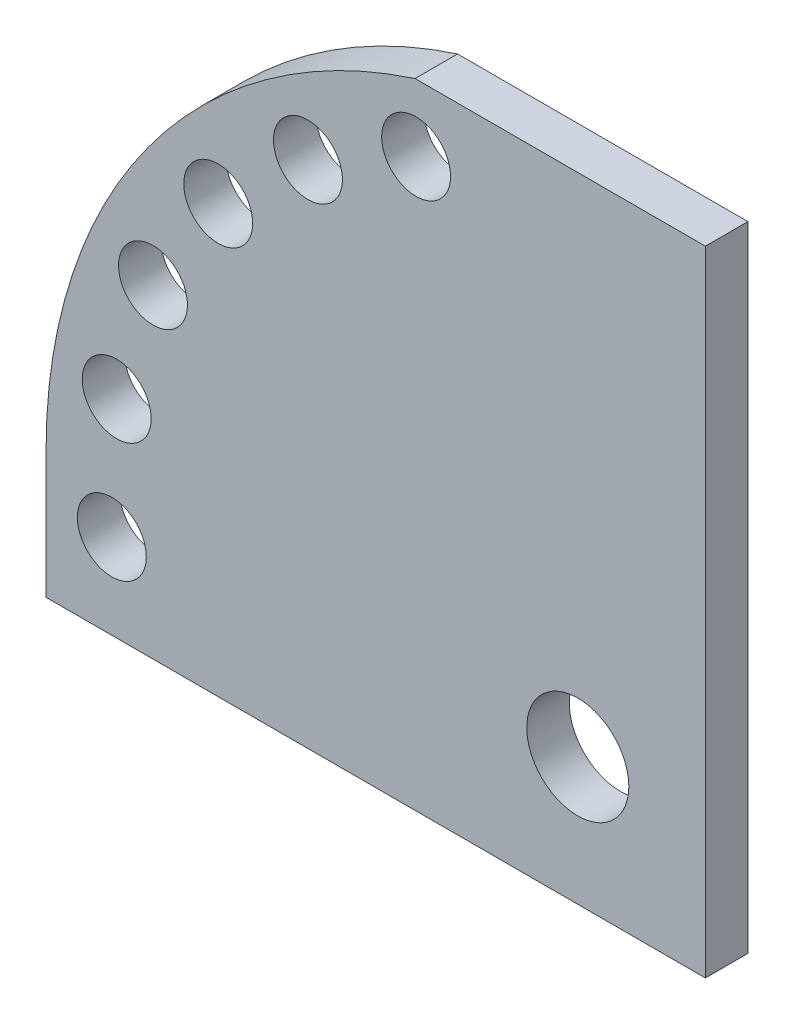
ISO-10303-21;
HEADER;
FILE_DESCRIPTION(('STEP AP214'),'2;1');
FILE_NAME('part.step','',(''),(''),'','','');
FILE_SCHEMA(('AUTOMOTIVE_DESIGN { 1 0 10303 214 1 1 1 1 }'));
ENDSEC;
DATA;
#1=APPLICATION_CONTEXT('core data for automotive mechanical design processes');
#2=APPLICATION_PROTOCOL_DEFINITION('international standard','automotive_design',2000,#1);
#3=PRODUCT_CONTEXT('',#1,'mechanical');
#4=PRODUCT('Part','Part','',(#3));
#5=PRODUCT_RELATED_PRODUCT_CATEGORY('part','',(#4));
#6=PRODUCT_DEFINITION_FORMATION('','',#4);
#7=PRODUCT_DEFINITION_CONTEXT('part definition',#1,'design');
#8=PRODUCT_DEFINITION('design','',#6,#7);
#9=PRODUCT_DEFINITION_SHAPE('','',#8);
#10=(LENGTH_UNIT() NAMED_UNIT(*) SI_UNIT(.MILLI.,.METRE.));
#11=(NAMED_UNIT(*) PLANE_ANGLE_UNIT() SI_UNIT($,.RADIAN.));
#12=(NAMED_UNIT(*) SI_UNIT($,.STERADIAN.) SOLID_ANGLE_UNIT());
#13=UNCERTAINTY_MEASURE_WITH_UNIT(LENGTH_MEASURE(1.E-05),#10,'distance_accuracy_value','');
#14=(GEOMETRIC_REPRESENTATION_CONTEXT(3) GLOBAL_UNCERTAINTY_ASSIGNED_CONTEXT((#13)) GLOBAL_UNIT_ASSIGNED_CONTEXT((#10,
#11,#12)) REPRESENTATION_CONTEXT('',''));
#15=CARTESIAN_POINT('',(0.,0.,0.));
#16=DIRECTION('',(0.,0.,1.));
#17=DIRECTION('',(1.,0.,0.));
#18=AXIS2_PLACEMENT_3D('',#15,#16,#17);
#19=CARTESIAN_POINT('',(15.,-15.,5.));
#20=DIRECTION('',(-1.,0.,0.));
#21=DIRECTION('',(0.,0.,1.));
#22=AXIS2_PLACEMENT_3D('',#19,#20,#21);
#23=PLANE('',#22);
#24=DIRECTION('',(0.,0.,-1.));
#25=VECTOR('',#24,1.);
#26=CARTESIAN_POINT('',(15.,59.5,142.144426609323));
#27=LINE('',#26,#25);
#28=CARTESIAN_POINT('',(15.,59.5,5.));
#29=VERTEX_POINT('',#28);
#30=CARTESIAN_POINT('',(15.,59.5,0.));
#31=VERTEX_POINT('',#30);
#32=EDGE_CURVE('E57',#29,#31,#27,.T.);
#33=ORIENTED_EDGE('',*,*,#32,.F.);
#34=DIRECTION('',(0.,1.,0.));
#35=VECTOR('',#34,1.);
#36=CARTESIAN_POINT('',(15.,-15.,5.));
#37=LINE('',#36,#35);
#38=CARTESIAN_POINT('',(15.,-15.,5.));
#39=VERTEX_POINT('',#38);
#40=EDGE_CURVE('E140',#39,#29,#37,.T.);
#41=ORIENTED_EDGE('',*,*,#40,.F.);
#42=DIRECTION('',(0.,0.,-1.));
#43=VECTOR('',#42,1.);
#44=CARTESIAN_POINT('',(15.,-15.,5.));
#45=LINE('',#44,#43);
#46=CARTESIAN_POINT('',(15.,-15.,0.));
#47=VERTEX_POINT('',#46);
#48=EDGE_CURVE('E143',#39,#47,#45,.T.);
#49=ORIENTED_EDGE('',*,*,#48,.T.);
#50=DIRECTION('',(0.,1.,0.));
#51=VECTOR('',#50,1.);
#52=CARTESIAN_POINT('',(15.,-15.,0.));
#53=LINE('',#52,#51);
#54=EDGE_CURVE('E132',#47,#31,#53,.T.);
#55=ORIENTED_EDGE('',*,*,#54,.T.);
#56=EDGE_LOOP('',(#33,#41,#49,#55));
#57=FACE_BOUND('',#56,.T.);
#58=ADVANCED_FACE('F41',(#57),#23,.F.);
#59=CARTESIAN_POINT('',(0.,0.,5.));
#60=DIRECTION('',(0.,0.,-1.));
#61=DIRECTION('',(-1.,0.,0.));
#62=AXIS2_PLACEMENT_3D('',#59,#60,#61);
#63=PLANE('',#62);
#64=CARTESIAN_POINT('',(-54.2000316190465,9.34647380001444,5.));
#65=DIRECTION('',(0.,0.,1.));
#66=DIRECTION('',(0.965925826289068,-0.258819045102521,0.));
#67=AXIS2_PLACEMENT_3D('',#64,#65,#66);
#68=CIRCLE('',#67,4.05);
#69=CARTESIAN_POINT('',(-50.2880320225758,8.29825666734923,5.));
#70=VERTEX_POINT('',#69);
#71=EDGE_CURVE('E342',#70,#70,#68,.T.);
#72=ORIENTED_EDGE('',*,*,#71,.F.);
#73=EDGE_LOOP('',(#72));
#74=FACE_BOUND('',#73,.T.);
#75=CARTESIAN_POINT('',(-49.9341649025257,23.0560008563362,5.));
#76=DIRECTION('',(0.,0.,1.));
#77=DIRECTION('',(0.866025403784438,-0.500000000000001,0.));
#78=AXIS2_PLACEMENT_3D('',#75,#76,#77);
#79=CIRCLE('',#78,4.05);
#80=CARTESIAN_POINT('',(-46.4267620171987,21.0310008563362,5.));
#81=VERTEX_POINT('',#80);
#82=EDGE_CURVE('E398',#81,#81,#79,.T.);
#83=ORIENTED_EDGE('',*,*,#82,.F.);
#84=EDGE_LOOP('',(#83));
#85=FACE_BOUND('',#84,.T.);
#86=CARTESIAN_POINT('',(-42.2653673680069,35.1942995561415,5.));
#87=DIRECTION('',(0.,0.,1.));
#88=DIRECTION('',(0.707106781186546,-0.707106781186549,0.));
#89=AXIS2_PLACEMENT_3D('',#86,#87,#88);
#90=CIRCLE('',#89,4.05);
#91=CARTESIAN_POINT('',(-39.4015849042013,32.330517092336,5.));
#92=VERTEX_POINT('',#91);
#93=EDGE_CURVE('E389',#92,#92,#90,.T.);
#94=ORIENTED_EDGE('',*,*,#93,.F.);
#95=EDGE_LOOP('',(#94));
#96=FACE_BOUND('',#95,.T.);
#97=CARTESIAN_POINT('',(-31.7162548941804,44.9341649025258,5.));
#98=DIRECTION('',(0.,0.,1.));
#99=DIRECTION('',(0.499999999999998,-0.86602540378444,0.));
#100=AXIS2_PLACEMENT_3D('',#97,#98,#99);
#101=CIRCLE('',#100,4.05);
#102=CARTESIAN_POINT('',(-29.6912548941804,41.4267620171988,5.));
#103=VERTEX_POINT('',#102);
#104=EDGE_CURVE('E356',#103,#103,#101,.T.);
#105=ORIENTED_EDGE('',*,*,#104,.F.);
#106=EDGE_LOOP('',(#105));
#107=FACE_BOUND('',#106,.T.);
#108=CARTESIAN_POINT('',(-19.005732062905,51.6118411680214,5.));
#109=DIRECTION('',(0.,0.,1.));
#110=DIRECTION('',(0.258819045102518,-0.965925826289069,0.));
#111=AXIS2_PLACEMENT_3D('',#108,#109,#110);
#112=CIRCLE('',#111,4.05);
#113=CARTESIAN_POINT('',(-17.9575149302398,47.6998415715507,5.));
#114=VERTEX_POINT('',#113);
#115=EDGE_CURVE('E345',#114,#114,#112,.T.);
#116=ORIENTED_EDGE('',*,*,#115,.F.);
#117=EDGE_LOOP('',(#116));
#118=FACE_BOUND('',#117,.T.);
#119=CARTESIAN_POINT('',(-54.7722557505166,-5.00000000000001,5.));
#120=DIRECTION('',(0.,0.,1.));
#121=DIRECTION('',(1.,0.,0.));
#122=AXIS2_PLACEMENT_3D('',#119,#120,#121);
#123=CIRCLE('',#122,4.05);
#124=CARTESIAN_POINT('',(-50.7222557505166,-5.00000000000001,5.));
#125=VERTEX_POINT('',#124);
#126=EDGE_CURVE('E335',#125,#125,#123,.T.);
#127=ORIENTED_EDGE('',*,*,#126,.F.);
#128=EDGE_LOOP('',(#127));
#129=FACE_BOUND('',#128,.T.);
#130=ORIENTED_EDGE('',*,*,#40,.T.);
#131=DIRECTION('',(-1.,0.,0.));
#132=VECTOR('',#131,1.);
#133=CARTESIAN_POINT('',(0.,59.5,5.));
#134=LINE('',#133,#132);
#135=CARTESIAN_POINT('',(-19.131126469709,59.5,5.));
#136=VERTEX_POINT('',#135);
#137=EDGE_CURVE('E64',#29,#136,#134,.T.);
#138=ORIENTED_EDGE('',*,*,#137,.T.);
#139=CARTESIAN_POINT('',(0.,0.,5.));
#140=DIRECTION('',(0.,0.,1.));
#141=DIRECTION('',(-1.,0.,0.));
#142=AXIS2_PLACEMENT_3D('',#139,#140,#141);
#143=CIRCLE('',#142,62.5);
#144=CARTESIAN_POINT('',(-62.5,0.,5.));
#145=VERTEX_POINT('',#144);
#146=EDGE_CURVE('E105',#136,#145,#143,.T.);
#147=ORIENTED_EDGE('',*,*,#146,.T.);
#148=DIRECTION('',(0.,-1.,0.));
#149=VECTOR('',#148,1.);
#150=CARTESIAN_POINT('',(-62.5,0.,5.));
#151=LINE('',#150,#149);
#152=CARTESIAN_POINT('',(-62.5,-15.,5.));
#153=VERTEX_POINT('',#152);
#154=EDGE_CURVE('E131',#145,#153,#151,.T.);
#155=ORIENTED_EDGE('',*,*,#154,.T.);
#156=DIRECTION('',(1.,0.,0.));
#157=VECTOR('',#156,1.);
#158=CARTESIAN_POINT('',(-62.5,-15.,5.));
#159=LINE('',#158,#157);
#160=EDGE_CURVE('E137',#153,#39,#159,.T.);
#161=ORIENTED_EDGE('',*,*,#160,.T.);
#162=EDGE_LOOP('',(#130,#138,#147,#155,#161));
#163=FACE_BOUND('',#162,.T.);
#164=CARTESIAN_POINT('',(0.,0.,5.));
#165=DIRECTION('',(0.,0.,1.));
#166=DIRECTION('',(1.,0.,0.));
#167=AXIS2_PLACEMENT_3D('',#164,#165,#166);
#168=CIRCLE('',#167,6.);
#169=CARTESIAN_POINT('',(6.,0.,5.));
#170=VERTEX_POINT('',#169);
#171=EDGE_CURVE('E101',#170,#170,#168,.T.);
#172=ORIENTED_EDGE('',*,*,#171,.F.);
#173=EDGE_LOOP('',(#172));
#174=FACE_BOUND('',#173,.T.);
#175=ADVANCED_FACE('F166',(#74,#85,#96,#107,#118,#129,#163,#174),#63,.F.);
#176=CARTESIAN_POINT('',(0.,0.,0.));
#177=DIRECTION('',(0.,0.,-1.));
#178=DIRECTION('',(-1.,0.,0.));
#179=AXIS2_PLACEMENT_3D('',#176,#177,#178);
#180=PLANE('',#179);
#181=DIRECTION('',(-1.,0.,0.));
#182=VECTOR('',#181,1.);
#183=CARTESIAN_POINT('',(0.,59.5,0.));
#184=LINE('',#183,#182);
#185=CARTESIAN_POINT('',(-19.131126469709,59.5,0.));
#186=VERTEX_POINT('',#185);
#187=EDGE_CURVE('E12',#31,#186,#184,.T.);
#188=ORIENTED_EDGE('',*,*,#187,.F.);
#189=ORIENTED_EDGE('',*,*,#54,.F.);
#190=DIRECTION('',(1.,0.,0.));
#191=VECTOR('',#190,1.);
#192=CARTESIAN_POINT('',(-62.5,-15.,0.));
#193=LINE('',#192,#191);
#194=CARTESIAN_POINT('',(-62.5,-15.,0.));
#195=VERTEX_POINT('',#194);
#196=EDGE_CURVE('E147',#195,#47,#193,.T.);
#197=ORIENTED_EDGE('',*,*,#196,.F.);
#198=DIRECTION('',(0.,-1.,0.));
#199=VECTOR('',#198,1.);
#200=CARTESIAN_POINT('',(-62.5,0.,0.));
#201=LINE('',#200,#199);
#202=CARTESIAN_POINT('',(-62.5,0.,0.));
#203=VERTEX_POINT('',#202);
#204=EDGE_CURVE('E96',#203,#195,#201,.T.);
#205=ORIENTED_EDGE('',*,*,#204,.F.);
#206=CARTESIAN_POINT('',(0.,0.,0.));
#207=DIRECTION('',(0.,0.,1.));
#208=DIRECTION('',(-1.,0.,0.));
#209=AXIS2_PLACEMENT_3D('',#206,#207,#208);
#210=CIRCLE('',#209,62.5);
#211=EDGE_CURVE('E90',#186,#203,#210,.T.);
#212=ORIENTED_EDGE('',*,*,#211,.F.);
#213=EDGE_LOOP('',(#188,#189,#197,#205,#212));
#214=FACE_BOUND('',#213,.T.);
#215=CARTESIAN_POINT('',(-54.2000316190465,9.34647380001444,0.));
#216=DIRECTION('',(0.,0.,1.));
#217=DIRECTION('',(0.965925826289068,-0.258819045102521,0.));
#218=AXIS2_PLACEMENT_3D('',#215,#216,#217);
#219=CIRCLE('',#218,4.05);
#220=CARTESIAN_POINT('',(-50.2880320225758,8.29825666734923,0.));
#221=VERTEX_POINT('',#220);
#222=EDGE_CURVE('E118',#221,#221,#219,.T.);
#223=ORIENTED_EDGE('',*,*,#222,.T.);
#224=EDGE_LOOP('',(#223));
#225=FACE_BOUND('',#224,.T.);
#226=CARTESIAN_POINT('',(-49.9341649025257,23.0560008563362,0.));
#227=DIRECTION('',(0.,0.,1.));
#228=DIRECTION('',(0.866025403784438,-0.500000000000001,0.));
#229=AXIS2_PLACEMENT_3D('',#226,#227,#228);
#230=CIRCLE('',#229,4.05);
#231=CARTESIAN_POINT('',(-46.4267620171987,21.0310008563362,0.));
#232=VERTEX_POINT('',#231);
#233=EDGE_CURVE('E394',#232,#232,#230,.T.);
#234=ORIENTED_EDGE('',*,*,#233,.T.);
#235=EDGE_LOOP('',(#234));
#236=FACE_BOUND('',#235,.T.);
#237=CARTESIAN_POINT('',(-42.2653673680069,35.1942995561415,0.));
#238=DIRECTION('',(0.,0.,1.));
#239=DIRECTION('',(0.707106781186546,-0.707106781186549,0.));
#240=AXIS2_PLACEMENT_3D('',#237,#238,#239);
#241=CIRCLE('',#240,4.05);
#242=CARTESIAN_POINT('',(-39.4015849042013,32.330517092336,0.));
#243=VERTEX_POINT('',#242);
#244=EDGE_CURVE('E361',#243,#243,#241,.T.);
#245=ORIENTED_EDGE('',*,*,#244,.T.);
#246=EDGE_LOOP('',(#245));
#247=FACE_BOUND('',#246,.T.);
#248=CARTESIAN_POINT('',(-31.7162548941804,44.9341649025258,0.));
#249=DIRECTION('',(0.,0.,1.));
#250=DIRECTION('',(0.499999999999998,-0.86602540378444,0.));
#251=AXIS2_PLACEMENT_3D('',#248,#249,#250);
#252=CIRCLE('',#251,4.05);
#253=CARTESIAN_POINT('',(-29.6912548941804,41.4267620171988,0.));
#254=VERTEX_POINT('',#253);
#255=EDGE_CURVE('E362',#254,#254,#252,.T.);
#256=ORIENTED_EDGE('',*,*,#255,.T.);
#257=EDGE_LOOP('',(#256));
#258=FACE_BOUND('',#257,.T.);
#259=CARTESIAN_POINT('',(-19.005732062905,51.6118411680214,0.));
#260=DIRECTION('',(0.,0.,1.));
#261=DIRECTION('',(0.258819045102518,-0.965925826289069,0.));
#262=AXIS2_PLACEMENT_3D('',#259,#260,#261);
#263=CIRCLE('',#262,4.05);
#264=CARTESIAN_POINT('',(-17.9575149302398,47.6998415715507,0.));
#265=VERTEX_POINT('',#264);
#266=EDGE_CURVE('E117',#265,#265,#263,.T.);
#267=ORIENTED_EDGE('',*,*,#266,.T.);
#268=EDGE_LOOP('',(#267));
#269=FACE_BOUND('',#268,.T.);
#270=CARTESIAN_POINT('',(-54.7722557505166,-5.00000000000001,0.));
#271=DIRECTION('',(0.,0.,1.));
#272=DIRECTION('',(1.,0.,0.));
#273=AXIS2_PLACEMENT_3D('',#270,#271,#272);
#274=CIRCLE('',#273,4.05);
#275=CARTESIAN_POINT('',(-50.7222557505166,-5.00000000000001,0.));
#276=VERTEX_POINT('',#275);
#277=EDGE_CURVE('E330',#276,#276,#274,.T.);
#278=ORIENTED_EDGE('',*,*,#277,.T.);
#279=EDGE_LOOP('',(#278));
#280=FACE_BOUND('',#279,.T.);
#281=CARTESIAN_POINT('',(0.,0.,0.));
#282=DIRECTION('',(0.,0.,1.));
#283=DIRECTION('',(1.,0.,0.));
#284=AXIS2_PLACEMENT_3D('',#281,#282,#283);
#285=CIRCLE('',#284,6.);
#286=CARTESIAN_POINT('',(6.,0.,0.));
#287=VERTEX_POINT('',#286);
#288=EDGE_CURVE('E133',#287,#287,#285,.T.);
#289=ORIENTED_EDGE('',*,*,#288,.T.);
#290=EDGE_LOOP('',(#289));
#291=FACE_BOUND('',#290,.T.);
#292=ADVANCED_FACE('F92',(#214,#225,#236,#247,#258,#269,#280,#291),#180,.T.);
#293=CARTESIAN_POINT('',(0.,0.,5.));
#294=DIRECTION('',(0.,0.,-1.));
#295=DIRECTION('',(-1.,0.,0.));
#296=AXIS2_PLACEMENT_3D('',#293,#294,#295);
#297=CYLINDRICAL_SURFACE('',#296,62.5);
#298=ORIENTED_EDGE('',*,*,#146,.F.);
#299=DIRECTION('',(0.,0.,-1.));
#300=VECTOR('',#299,1.);
#301=CARTESIAN_POINT('',(-19.131126469709,59.5,142.144426609323));
#302=LINE('',#301,#300);
#303=EDGE_CURVE('E104',#136,#186,#302,.T.);
#304=ORIENTED_EDGE('',*,*,#303,.T.);
#305=ORIENTED_EDGE('',*,*,#211,.T.);
#306=DIRECTION('',(0.,0.,-1.));
#307=VECTOR('',#306,1.);
#308=CARTESIAN_POINT('',(-62.5,0.,5.));
#309=LINE('',#308,#307);
#310=EDGE_CURVE('E50',#145,#203,#309,.T.);
#311=ORIENTED_EDGE('',*,*,#310,.F.);
#312=EDGE_LOOP('',(#298,#304,#305,#311));
#313=FACE_BOUND('',#312,.T.);
#314=ADVANCED_FACE('F43',(#313),#297,.T.);
#315=CARTESIAN_POINT('',(-62.5,0.,5.));
#316=DIRECTION('',(1.,0.,0.));
#317=DIRECTION('',(0.,0.,-1.));
#318=AXIS2_PLACEMENT_3D('',#315,#316,#317);
#319=PLANE('',#318);
#320=ORIENTED_EDGE('',*,*,#204,.T.);
#321=DIRECTION('',(0.,0.,-1.));
#322=VECTOR('',#321,1.);
#323=CARTESIAN_POINT('',(-62.5,-15.,5.));
#324=LINE('',#323,#322);
#325=EDGE_CURVE('E155',#153,#195,#324,.T.);
#326=ORIENTED_EDGE('',*,*,#325,.F.);
#327=ORIENTED_EDGE('',*,*,#154,.F.);
#328=ORIENTED_EDGE('',*,*,#310,.T.);
#329=EDGE_LOOP('',(#320,#326,#327,#328));
#330=FACE_BOUND('',#329,.T.);
#331=ADVANCED_FACE('F163',(#330),#319,.F.);
#332=CARTESIAN_POINT('',(-62.5,-15.,5.));
#333=DIRECTION('',(0.,1.,0.));
#334=DIRECTION('',(0.,0.,1.));
#335=AXIS2_PLACEMENT_3D('',#332,#333,#334);
#336=PLANE('',#335);
#337=ORIENTED_EDGE('',*,*,#196,.T.);
#338=ORIENTED_EDGE('',*,*,#48,.F.);
#339=ORIENTED_EDGE('',*,*,#160,.F.);
#340=ORIENTED_EDGE('',*,*,#325,.T.);
#341=EDGE_LOOP('',(#337,#338,#339,#340));
#342=FACE_BOUND('',#341,.T.);
#343=ADVANCED_FACE('F170',(#342),#336,.F.);
#344=CARTESIAN_POINT('',(0.,0.,5.));
#345=DIRECTION('',(0.,0.,-1.));
#346=DIRECTION('',(-1.,0.,0.));
#347=AXIS2_PLACEMENT_3D('',#344,#345,#346);
#348=CYLINDRICAL_SURFACE('',#347,6.);
#349=ORIENTED_EDGE('',*,*,#171,.T.);
#350=EDGE_LOOP('',(#349));
#351=FACE_BOUND('',#350,.T.);
#352=ORIENTED_EDGE('',*,*,#288,.F.);
#353=EDGE_LOOP('',(#352));
#354=FACE_BOUND('',#353,.T.);
#355=ADVANCED_FACE('F181',(#351,#354),#348,.F.);
#356=CARTESIAN_POINT('',(-54.7722557505166,-5.00000000000001,0.));
#357=DIRECTION('',(0.,0.,1.));
#358=DIRECTION('',(1.,0.,0.));
#359=AXIS2_PLACEMENT_3D('',#356,#357,#358);
#360=CYLINDRICAL_SURFACE('',#359,4.05);
#361=ORIENTED_EDGE('',*,*,#277,.F.);
#362=EDGE_LOOP('',(#361));
#363=FACE_BOUND('',#362,.T.);
#364=ORIENTED_EDGE('',*,*,#126,.T.);
#365=EDGE_LOOP('',(#364));
#366=FACE_BOUND('',#365,.T.);
#367=ADVANCED_FACE('F266',(#363,#366),#360,.F.);
#368=CARTESIAN_POINT('',(-19.005732062905,51.6118411680214,0.));
#369=DIRECTION('',(0.,0.,1.));
#370=DIRECTION('',(0.258819045102518,-0.965925826289069,0.));
#371=AXIS2_PLACEMENT_3D('',#368,#369,#370);
#372=CYLINDRICAL_SURFACE('',#371,4.05);
#373=ORIENTED_EDGE('',*,*,#266,.F.);
#374=EDGE_LOOP('',(#373));
#375=FACE_BOUND('',#374,.T.);
#376=ORIENTED_EDGE('',*,*,#115,.T.);
#377=EDGE_LOOP('',(#376));
#378=FACE_BOUND('',#377,.T.);
#379=ADVANCED_FACE('F257',(#375,#378),#372,.F.);
#380=CARTESIAN_POINT('',(-31.7162548941804,44.9341649025258,0.));
#381=DIRECTION('',(0.,0.,1.));
#382=DIRECTION('',(0.499999999999998,-0.86602540378444,0.));
#383=AXIS2_PLACEMENT_3D('',#380,#381,#382);
#384=CYLINDRICAL_SURFACE('',#383,4.05);
#385=ORIENTED_EDGE('',*,*,#255,.F.);
#386=EDGE_LOOP('',(#385));
#387=FACE_BOUND('',#386,.T.);
#388=ORIENTED_EDGE('',*,*,#104,.T.);
#389=EDGE_LOOP('',(#388));
#390=FACE_BOUND('',#389,.T.);
#391=ADVANCED_FACE('F248',(#387,#390),#384,.F.);
#392=CARTESIAN_POINT('',(-42.2653673680069,35.1942995561415,0.));
#393=DIRECTION('',(0.,0.,1.));
#394=DIRECTION('',(0.707106781186546,-0.707106781186549,0.));
#395=AXIS2_PLACEMENT_3D('',#392,#393,#394);
#396=CYLINDRICAL_SURFACE('',#395,4.05);
#397=ORIENTED_EDGE('',*,*,#244,.F.);
#398=EDGE_LOOP('',(#397));
#399=FACE_BOUND('',#398,.T.);
#400=ORIENTED_EDGE('',*,*,#93,.T.);
#401=EDGE_LOOP('',(#400));
#402=FACE_BOUND('',#401,.T.);
#403=ADVANCED_FACE('F239',(#399,#402),#396,.F.);
#404=CARTESIAN_POINT('',(-49.9341649025257,23.0560008563362,0.));
#405=DIRECTION('',(0.,0.,1.));
#406=DIRECTION('',(0.866025403784438,-0.500000000000001,0.));
#407=AXIS2_PLACEMENT_3D('',#404,#405,#406);
#408=CYLINDRICAL_SURFACE('',#407,4.05);
#409=ORIENTED_EDGE('',*,*,#233,.F.);
#410=EDGE_LOOP('',(#409));
#411=FACE_BOUND('',#410,.T.);
#412=ORIENTED_EDGE('',*,*,#82,.T.);
#413=EDGE_LOOP('',(#412));
#414=FACE_BOUND('',#413,.T.);
#415=ADVANCED_FACE('F230',(#411,#414),#408,.F.);
#416=CARTESIAN_POINT('',(-54.2000316190465,9.34647380001444,0.));
#417=DIRECTION('',(0.,0.,1.));
#418=DIRECTION('',(0.965925826289068,-0.258819045102521,0.));
#419=AXIS2_PLACEMENT_3D('',#416,#417,#418);
#420=CYLINDRICAL_SURFACE('',#419,4.05);
#421=ORIENTED_EDGE('',*,*,#222,.F.);
#422=EDGE_LOOP('',(#421));
#423=FACE_BOUND('',#422,.T.);
#424=ORIENTED_EDGE('',*,*,#71,.T.);
#425=EDGE_LOOP('',(#424));
#426=FACE_BOUND('',#425,.T.);
#427=ADVANCED_FACE('F226',(#423,#426),#420,.F.);
#428=CARTESIAN_POINT('',(15.,59.5,142.144426609323));
#429=DIRECTION('',(0.,-1.,0.));
#430=DIRECTION('',(1.,0.,0.));
#431=AXIS2_PLACEMENT_3D('',#428,#429,#430);
#432=PLANE('',#431);
#433=ORIENTED_EDGE('',*,*,#137,.F.);
#434=ORIENTED_EDGE('',*,*,#32,.T.);
#435=ORIENTED_EDGE('',*,*,#187,.T.);
#436=ORIENTED_EDGE('',*,*,#303,.F.);
#437=EDGE_LOOP('',(#433,#434,#435,#436));
#438=FACE_BOUND('',#437,.T.);
#439=ADVANCED_FACE('F109',(#438),#432,.F.);
#440=CLOSED_SHELL('',(#58,#175,#292,#314,#331,#343,#355,#367,#379,#391,#403,#415,#427,#439));
#441=MANIFOLD_SOLID_BREP('B2',#440);
#442=ADVANCED_BREP_SHAPE_REPRESENTATION('',(#18,#441),#14);
#443=SHAPE_DEFINITION_REPRESENTATION(#9,#442);
ENDSEC;
END-ISO-10303-21;
